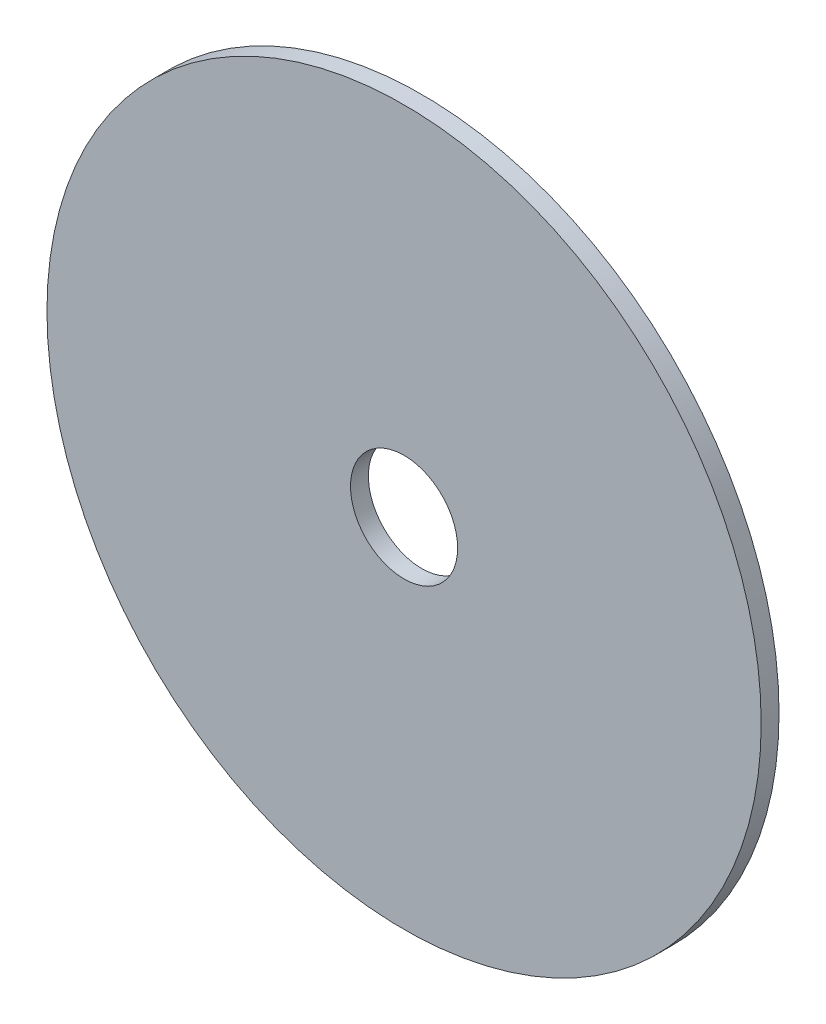
ISO-10303-21;
HEADER;
FILE_DESCRIPTION(('STEP AP214'),'2;1');
FILE_NAME('part.step','',(''),(''),'','','');
FILE_SCHEMA(('AUTOMOTIVE_DESIGN { 1 0 10303 214 1 1 1 1 }'));
ENDSEC;
DATA;
#1=APPLICATION_CONTEXT('core data for automotive mechanical design processes');
#2=APPLICATION_PROTOCOL_DEFINITION('international standard','automotive_design',2000,#1);
#3=PRODUCT_CONTEXT('',#1,'mechanical');
#4=PRODUCT('Part','Part','',(#3));
#5=PRODUCT_RELATED_PRODUCT_CATEGORY('part','',(#4));
#6=PRODUCT_DEFINITION_FORMATION('','',#4);
#7=PRODUCT_DEFINITION_CONTEXT('part definition',#1,'design');
#8=PRODUCT_DEFINITION('design','',#6,#7);
#9=PRODUCT_DEFINITION_SHAPE('','',#8);
#10=(LENGTH_UNIT() NAMED_UNIT(*) SI_UNIT(.MILLI.,.METRE.));
#11=(NAMED_UNIT(*) PLANE_ANGLE_UNIT() SI_UNIT($,.RADIAN.));
#12=(NAMED_UNIT(*) SI_UNIT($,.STERADIAN.) SOLID_ANGLE_UNIT());
#13=UNCERTAINTY_MEASURE_WITH_UNIT(LENGTH_MEASURE(1.E-05),#10,'distance_accuracy_value','');
#14=(GEOMETRIC_REPRESENTATION_CONTEXT(3) GLOBAL_UNCERTAINTY_ASSIGNED_CONTEXT((#13)) GLOBAL_UNIT_ASSIGNED_CONTEXT((#10,
#11,#12)) REPRESENTATION_CONTEXT('',''));
#15=CARTESIAN_POINT('',(0.,0.,0.));
#16=DIRECTION('',(0.,0.,1.));
#17=DIRECTION('',(1.,0.,0.));
#18=AXIS2_PLACEMENT_3D('',#15,#16,#17);
#19=CARTESIAN_POINT('',(0.,0.,5.));
#20=DIRECTION('',(0.,0.,1.));
#21=DIRECTION('',(1.,0.,0.));
#22=AXIS2_PLACEMENT_3D('',#19,#20,#21);
#23=PLANE('',#22);
#24=CARTESIAN_POINT('',(0.,0.,5.));
#25=DIRECTION('',(0.,0.,1.));
#26=DIRECTION('',(1.,0.,0.));
#27=AXIS2_PLACEMENT_3D('',#24,#25,#26);
#28=CIRCLE('',#27,100.);
#29=CARTESIAN_POINT('',(100.,0.,5.));
#30=VERTEX_POINT('',#29);
#31=EDGE_CURVE('E10',#30,#30,#28,.T.);
#32=ORIENTED_EDGE('',*,*,#31,.T.);
#33=EDGE_LOOP('',(#32));
#34=FACE_BOUND('',#33,.T.);
#35=CARTESIAN_POINT('',(0.,0.,5.));
#36=DIRECTION('',(0.,0.,1.));
#37=DIRECTION('',(1.,0.,0.));
#38=AXIS2_PLACEMENT_3D('',#35,#36,#37);
#39=CIRCLE('',#38,15.);
#40=CARTESIAN_POINT('',(15.,0.,5.));
#41=VERTEX_POINT('',#40);
#42=EDGE_CURVE('E41',#41,#41,#39,.T.);
#43=ORIENTED_EDGE('',*,*,#42,.F.);
#44=EDGE_LOOP('',(#43));
#45=FACE_BOUND('',#44,.T.);
#46=ADVANCED_FACE('F30',(#34,#45),#23,.T.);
#47=CARTESIAN_POINT('',(0.,0.,0.));
#48=DIRECTION('',(0.,0.,1.));
#49=DIRECTION('',(1.,0.,0.));
#50=AXIS2_PLACEMENT_3D('',#47,#48,#49);
#51=PLANE('',#50);
#52=CARTESIAN_POINT('',(0.,0.,0.));
#53=DIRECTION('',(0.,0.,1.));
#54=DIRECTION('',(1.,0.,0.));
#55=AXIS2_PLACEMENT_3D('',#52,#53,#54);
#56=CIRCLE('',#55,100.);
#57=CARTESIAN_POINT('',(100.,0.,0.));
#58=VERTEX_POINT('',#57);
#59=EDGE_CURVE('E34',#58,#58,#56,.T.);
#60=ORIENTED_EDGE('',*,*,#59,.F.);
#61=EDGE_LOOP('',(#60));
#62=FACE_BOUND('',#61,.T.);
#63=CARTESIAN_POINT('',(0.,0.,0.));
#64=DIRECTION('',(0.,0.,1.));
#65=DIRECTION('',(1.,0.,0.));
#66=AXIS2_PLACEMENT_3D('',#63,#64,#65);
#67=CIRCLE('',#66,15.);
#68=CARTESIAN_POINT('',(15.,0.,0.));
#69=VERTEX_POINT('',#68);
#70=EDGE_CURVE('E43',#69,#69,#67,.T.);
#71=ORIENTED_EDGE('',*,*,#70,.T.);
#72=EDGE_LOOP('',(#71));
#73=FACE_BOUND('',#72,.T.);
#74=ADVANCED_FACE('F53',(#62,#73),#51,.F.);
#75=CARTESIAN_POINT('',(0.,0.,5.));
#76=DIRECTION('',(0.,0.,-1.));
#77=DIRECTION('',(-1.,0.,0.));
#78=AXIS2_PLACEMENT_3D('',#75,#76,#77);
#79=CYLINDRICAL_SURFACE('',#78,100.);
#80=ORIENTED_EDGE('',*,*,#31,.F.);
#81=EDGE_LOOP('',(#80));
#82=FACE_BOUND('',#81,.T.);
#83=ORIENTED_EDGE('',*,*,#59,.T.);
#84=EDGE_LOOP('',(#83));
#85=FACE_BOUND('',#84,.T.);
#86=ADVANCED_FACE('F32',(#82,#85),#79,.T.);
#87=CARTESIAN_POINT('',(0.,0.,5.));
#88=DIRECTION('',(0.,0.,-1.));
#89=DIRECTION('',(-1.,0.,0.));
#90=AXIS2_PLACEMENT_3D('',#87,#88,#89);
#91=CYLINDRICAL_SURFACE('',#90,15.);
#92=ORIENTED_EDGE('',*,*,#42,.T.);
#93=EDGE_LOOP('',(#92));
#94=FACE_BOUND('',#93,.T.);
#95=ORIENTED_EDGE('',*,*,#70,.F.);
#96=EDGE_LOOP('',(#95));
#97=FACE_BOUND('',#96,.T.);
#98=ADVANCED_FACE('F49',(#94,#97),#91,.F.);
#99=CLOSED_SHELL('',(#46,#74,#86,#98));
#100=MANIFOLD_SOLID_BREP('B2',#99);
#101=ADVANCED_BREP_SHAPE_REPRESENTATION('',(#18,#100),#14);
#102=SHAPE_DEFINITION_REPRESENTATION(#9,#101);
ENDSEC;
END-ISO-10303-21;
